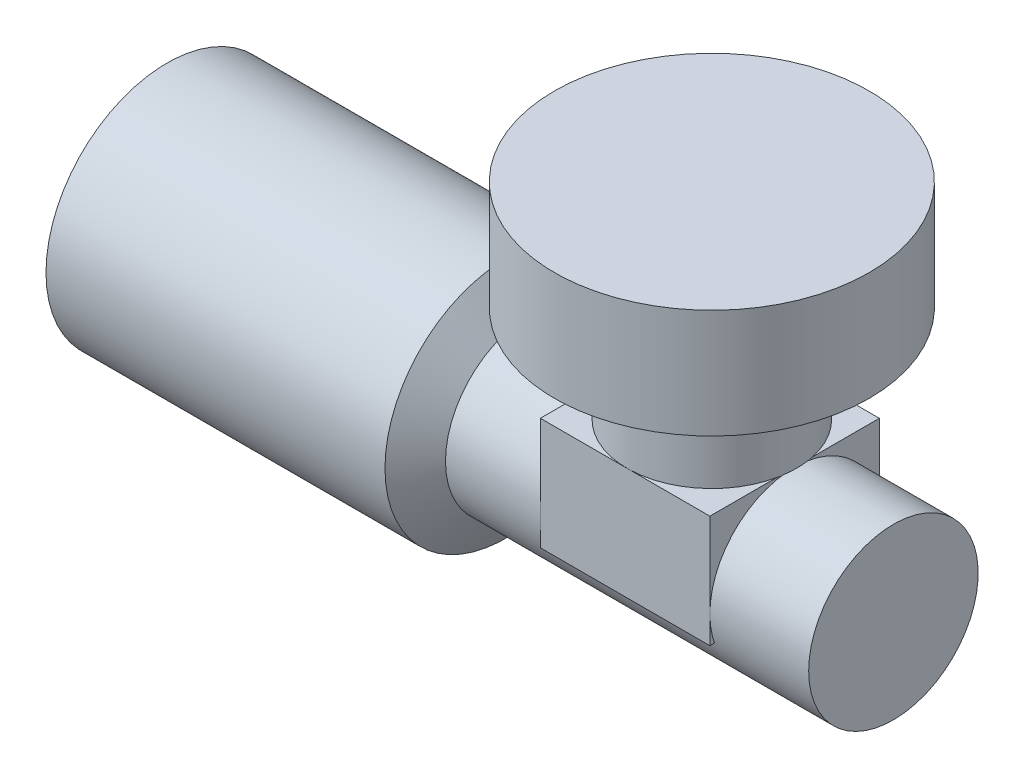
ISO-10303-21;
HEADER;
FILE_DESCRIPTION(('STEP AP214'),'2;1');
FILE_NAME('part.step','',(''),(''),'','','');
FILE_SCHEMA(('AUTOMOTIVE_DESIGN { 1 0 10303 214 1 1 1 1 }'));
ENDSEC;
DATA;
#1=APPLICATION_CONTEXT('core data for automotive mechanical design processes');
#2=APPLICATION_PROTOCOL_DEFINITION('international standard','automotive_design',2000,#1);
#3=PRODUCT_CONTEXT('',#1,'mechanical');
#4=PRODUCT('Part','Part','',(#3));
#5=PRODUCT_RELATED_PRODUCT_CATEGORY('part','',(#4));
#6=PRODUCT_DEFINITION_FORMATION('','',#4);
#7=PRODUCT_DEFINITION_CONTEXT('part definition',#1,'design');
#8=PRODUCT_DEFINITION('design','',#6,#7);
#9=PRODUCT_DEFINITION_SHAPE('','',#8);
#10=(LENGTH_UNIT() NAMED_UNIT(*) SI_UNIT(.MILLI.,.METRE.));
#11=(NAMED_UNIT(*) PLANE_ANGLE_UNIT() SI_UNIT($,.RADIAN.));
#12=(NAMED_UNIT(*) SI_UNIT($,.STERADIAN.) SOLID_ANGLE_UNIT());
#13=UNCERTAINTY_MEASURE_WITH_UNIT(LENGTH_MEASURE(1.E-05),#10,'distance_accuracy_value','');
#14=(GEOMETRIC_REPRESENTATION_CONTEXT(3) GLOBAL_UNCERTAINTY_ASSIGNED_CONTEXT((#13)) GLOBAL_UNIT_ASSIGNED_CONTEXT((#10,
#11,#12)) REPRESENTATION_CONTEXT('',''));
#15=CARTESIAN_POINT('',(0.,0.,0.));
#16=DIRECTION('',(0.,0.,1.));
#17=DIRECTION('',(1.,0.,0.));
#18=AXIS2_PLACEMENT_3D('',#15,#16,#17);
#19=CARTESIAN_POINT('',(20.5,7.,7.));
#20=DIRECTION('',(0.,0.,-1.));
#21=DIRECTION('',(-1.,0.,0.));
#22=AXIS2_PLACEMENT_3D('',#19,#20,#21);
#23=PLANE('',#22);
#24=DIRECTION('',(0.,-1.,0.));
#25=VECTOR('',#24,1.);
#26=CARTESIAN_POINT('',(6.5,7.,7.));
#27=LINE('',#26,#25);
#28=CARTESIAN_POINT('',(6.5,7.,7.));
#29=VERTEX_POINT('',#28);
#30=CARTESIAN_POINT('',(6.5,-2.26917805547654,7.));
#31=VERTEX_POINT('',#30);
#32=EDGE_CURVE('E106',#29,#31,#27,.T.);
#33=ORIENTED_EDGE('',*,*,#32,.T.);
#34=DIRECTION('',(-1.,0.,0.));
#35=VECTOR('',#34,1.);
#36=CARTESIAN_POINT('',(20.5,-2.26917805547654,7.));
#37=LINE('',#36,#35);
#38=CARTESIAN_POINT('',(20.5,-2.26917805547654,7.));
#39=VERTEX_POINT('',#38);
#40=EDGE_CURVE('E12',#39,#31,#37,.T.);
#41=ORIENTED_EDGE('',*,*,#40,.F.);
#42=DIRECTION('',(0.,-1.,0.));
#43=VECTOR('',#42,1.);
#44=CARTESIAN_POINT('',(20.5,7.,7.));
#45=LINE('',#44,#43);
#46=CARTESIAN_POINT('',(20.5,7.,7.));
#47=VERTEX_POINT('',#46);
#48=EDGE_CURVE('E94',#47,#39,#45,.T.);
#49=ORIENTED_EDGE('',*,*,#48,.F.);
#50=DIRECTION('',(-1.,0.,0.));
#51=VECTOR('',#50,1.);
#52=CARTESIAN_POINT('',(20.5,7.,7.));
#53=LINE('',#52,#51);
#54=EDGE_CURVE('E102',#47,#29,#53,.T.);
#55=ORIENTED_EDGE('',*,*,#54,.T.);
#56=EDGE_LOOP('',(#33,#41,#49,#55));
#57=FACE_BOUND('',#56,.T.);
#58=ADVANCED_FACE('F43',(#57),#23,.F.);
#59=CARTESIAN_POINT('',(20.5,-2.26917805547654,7.));
#60=DIRECTION('',(0.,1.,0.));
#61=DIRECTION('',(0.,0.,1.));
#62=AXIS2_PLACEMENT_3D('',#59,#60,#61);
#63=PLANE('',#62);
#64=DIRECTION('',(0.,0.,-1.));
#65=VECTOR('',#64,1.);
#66=CARTESIAN_POINT('',(6.5,-2.26917805547654,7.));
#67=LINE('',#66,#65);
#68=CARTESIAN_POINT('',(6.5,-2.26917805547654,-7.));
#69=VERTEX_POINT('',#68);
#70=EDGE_CURVE('E98',#31,#69,#67,.T.);
#71=ORIENTED_EDGE('',*,*,#70,.T.);
#72=DIRECTION('',(-1.,0.,0.));
#73=VECTOR('',#72,1.);
#74=CARTESIAN_POINT('',(20.5,-2.26917805547654,-7.));
#75=LINE('',#74,#73);
#76=CARTESIAN_POINT('',(20.5,-2.26917805547654,-7.));
#77=VERTEX_POINT('',#76);
#78=EDGE_CURVE('E51',#77,#69,#75,.T.);
#79=ORIENTED_EDGE('',*,*,#78,.F.);
#80=DIRECTION('',(0.,0.,-1.));
#81=VECTOR('',#80,1.);
#82=CARTESIAN_POINT('',(20.5,-2.26917805547654,7.));
#83=LINE('',#82,#81);
#84=EDGE_CURVE('E89',#39,#77,#83,.T.);
#85=ORIENTED_EDGE('',*,*,#84,.F.);
#86=ORIENTED_EDGE('',*,*,#40,.T.);
#87=EDGE_LOOP('',(#71,#79,#85,#86));
#88=FACE_BOUND('',#87,.T.);
#89=ADVANCED_FACE('F97',(#88),#63,.F.);
#90=CARTESIAN_POINT('',(20.5,7.,-7.));
#91=DIRECTION('',(0.,0.,1.));
#92=DIRECTION('',(1.,0.,0.));
#93=AXIS2_PLACEMENT_3D('',#90,#91,#92);
#94=PLANE('',#93);
#95=DIRECTION('',(0.,1.,0.));
#96=VECTOR('',#95,1.);
#97=CARTESIAN_POINT('',(6.5,7.,-7.));
#98=LINE('',#97,#96);
#99=CARTESIAN_POINT('',(6.5,7.,-7.));
#100=VERTEX_POINT('',#99);
#101=EDGE_CURVE('E76',#69,#100,#98,.T.);
#102=ORIENTED_EDGE('',*,*,#101,.T.);
#103=DIRECTION('',(-1.,0.,0.));
#104=VECTOR('',#103,1.);
#105=CARTESIAN_POINT('',(20.5,7.,-7.));
#106=LINE('',#105,#104);
#107=CARTESIAN_POINT('',(20.5,7.,-7.));
#108=VERTEX_POINT('',#107);
#109=EDGE_CURVE('E99',#108,#100,#106,.T.);
#110=ORIENTED_EDGE('',*,*,#109,.F.);
#111=DIRECTION('',(0.,1.,0.));
#112=VECTOR('',#111,1.);
#113=CARTESIAN_POINT('',(20.5,7.,-7.));
#114=LINE('',#113,#112);
#115=EDGE_CURVE('E92',#77,#108,#114,.T.);
#116=ORIENTED_EDGE('',*,*,#115,.F.);
#117=ORIENTED_EDGE('',*,*,#78,.T.);
#118=EDGE_LOOP('',(#102,#110,#116,#117));
#119=FACE_BOUND('',#118,.T.);
#120=ADVANCED_FACE('F100',(#119),#94,.F.);
#121=CARTESIAN_POINT('',(20.5,7.,7.));
#122=DIRECTION('',(0.,-1.,0.));
#123=DIRECTION('',(0.,0.,-1.));
#124=AXIS2_PLACEMENT_3D('',#121,#122,#123);
#125=PLANE('',#124);
#126=DIRECTION('',(0.,0.,1.));
#127=VECTOR('',#126,1.);
#128=CARTESIAN_POINT('',(6.5,7.,7.));
#129=LINE('',#128,#127);
#130=EDGE_CURVE('E82',#100,#29,#129,.T.);
#131=ORIENTED_EDGE('',*,*,#130,.T.);
#132=ORIENTED_EDGE('',*,*,#54,.F.);
#133=DIRECTION('',(0.,0.,1.));
#134=VECTOR('',#133,1.);
#135=CARTESIAN_POINT('',(20.5,7.,7.));
#136=LINE('',#135,#134);
#137=EDGE_CURVE('E59',#108,#47,#136,.T.);
#138=ORIENTED_EDGE('',*,*,#137,.F.);
#139=ORIENTED_EDGE('',*,*,#109,.T.);
#140=EDGE_LOOP('',(#131,#132,#138,#139));
#141=FACE_BOUND('',#140,.T.);
#142=ADVANCED_FACE('F113',(#141),#125,.F.);
#143=CARTESIAN_POINT('',(20.5,0.,0.));
#144=DIRECTION('',(1.,0.,0.));
#145=DIRECTION('',(0.,0.,-1.));
#146=AXIS2_PLACEMENT_3D('',#143,#144,#145);
#147=PLANE('',#146);
#148=ORIENTED_EDGE('',*,*,#48,.T.);
#149=ORIENTED_EDGE('',*,*,#84,.T.);
#150=ORIENTED_EDGE('',*,*,#115,.T.);
#151=ORIENTED_EDGE('',*,*,#137,.T.);
#152=EDGE_LOOP('',(#148,#149,#150,#151));
#153=FACE_BOUND('',#152,.T.);
#154=ADVANCED_FACE('F90',(#153),#147,.T.);
#155=CARTESIAN_POINT('',(6.5,0.,0.));
#156=DIRECTION('',(1.,0.,0.));
#157=DIRECTION('',(0.,0.,-1.));
#158=AXIS2_PLACEMENT_3D('',#155,#156,#157);
#159=PLANE('',#158);
#160=ORIENTED_EDGE('',*,*,#32,.F.);
#161=ORIENTED_EDGE('',*,*,#130,.F.);
#162=ORIENTED_EDGE('',*,*,#101,.F.);
#163=ORIENTED_EDGE('',*,*,#70,.F.);
#164=EDGE_LOOP('',(#160,#161,#162,#163));
#165=FACE_BOUND('',#164,.T.);
#166=ADVANCED_FACE('F116',(#165),#159,.F.);
#167=CLOSED_SHELL('',(#58,#89,#120,#142,#154,#166));
#168=MANIFOLD_SOLID_BREP('B2',#167);
#169=CARTESIAN_POINT('',(13.6629124709385,7.,0.));
#170=DIRECTION('',(0.,-1.,0.));
#171=DIRECTION('',(1.,0.,0.));
#172=AXIS2_PLACEMENT_3D('',#169,#170,#171);
#173=PLANE('',#172);
#174=CARTESIAN_POINT('',(13.6629124709385,7.,0.));
#175=DIRECTION('',(0.,1.,0.));
#176=DIRECTION('',(-1.,0.,0.));
#177=AXIS2_PLACEMENT_3D('',#174,#175,#176);
#178=CIRCLE('',#177,7.);
#179=CARTESIAN_POINT('',(6.66291247093846,7.,0.));
#180=VERTEX_POINT('',#179);
#181=EDGE_CURVE('E42',#180,#180,#178,.T.);
#182=ORIENTED_EDGE('',*,*,#181,.F.);
#183=EDGE_LOOP('',(#182));
#184=FACE_BOUND('',#183,.T.);
#185=ADVANCED_FACE('F173',(#184),#173,.T.);
#186=CARTESIAN_POINT('',(13.6629124709385,24.,0.));
#187=DIRECTION('',(0.,1.,0.));
#188=DIRECTION('',(-1.,0.,0.));
#189=AXIS2_PLACEMENT_3D('',#186,#187,#188);
#190=CYLINDRICAL_SURFACE('',#189,7.);
#191=ORIENTED_EDGE('',*,*,#181,.T.);
#192=EDGE_LOOP('',(#191));
#193=FACE_BOUND('',#192,.T.);
#194=CARTESIAN_POINT('',(13.6629124709385,13.,0.));
#195=DIRECTION('',(0.,1.,0.));
#196=DIRECTION('',(-1.,0.,0.));
#197=AXIS2_PLACEMENT_3D('',#194,#195,#196);
#198=CIRCLE('',#197,7.);
#199=CARTESIAN_POINT('',(6.66291247093846,13.,0.));
#200=VERTEX_POINT('',#199);
#201=EDGE_CURVE('E179',#200,#200,#198,.T.);
#202=ORIENTED_EDGE('',*,*,#201,.F.);
#203=EDGE_LOOP('',(#202));
#204=FACE_BOUND('',#203,.T.);
#205=ADVANCED_FACE('F205',(#193,#204),#190,.T.);
#206=CARTESIAN_POINT('',(13.6629124709385,15.,0.));
#207=DIRECTION('',(0.,1.,0.));
#208=DIRECTION('',(-1.,0.,0.));
#209=AXIS2_PLACEMENT_3D('',#206,#207,#208);
#210=CONICAL_SURFACE('',#209,13.,1.24904577239825);
#211=ORIENTED_EDGE('',*,*,#201,.T.);
#212=EDGE_LOOP('',(#211));
#213=FACE_BOUND('',#212,.T.);
#214=CARTESIAN_POINT('',(13.6629124709385,15.,0.));
#215=DIRECTION('',(0.,1.,0.));
#216=DIRECTION('',(-1.,0.,0.));
#217=AXIS2_PLACEMENT_3D('',#214,#215,#216);
#218=CIRCLE('',#217,13.);
#219=CARTESIAN_POINT('',(0.662912470938458,15.,0.));
#220=VERTEX_POINT('',#219);
#221=EDGE_CURVE('E183',#220,#220,#218,.T.);
#222=ORIENTED_EDGE('',*,*,#221,.F.);
#223=EDGE_LOOP('',(#222));
#224=FACE_BOUND('',#223,.T.);
#225=ADVANCED_FACE('F197',(#213,#224),#210,.T.);
#226=CARTESIAN_POINT('',(13.6629124709385,24.,0.));
#227=DIRECTION('',(0.,1.,0.));
#228=DIRECTION('',(-1.,0.,0.));
#229=AXIS2_PLACEMENT_3D('',#226,#227,#228);
#230=CYLINDRICAL_SURFACE('',#229,13.);
#231=ORIENTED_EDGE('',*,*,#221,.T.);
#232=EDGE_LOOP('',(#231));
#233=FACE_BOUND('',#232,.T.);
#234=CARTESIAN_POINT('',(13.6629124709385,24.,0.));
#235=DIRECTION('',(0.,1.,0.));
#236=DIRECTION('',(-1.,0.,0.));
#237=AXIS2_PLACEMENT_3D('',#234,#235,#236);
#238=CIRCLE('',#237,13.);
#239=CARTESIAN_POINT('',(0.662912470938458,24.,0.));
#240=VERTEX_POINT('',#239);
#241=EDGE_CURVE('E187',#240,#240,#238,.T.);
#242=ORIENTED_EDGE('',*,*,#241,.F.);
#243=EDGE_LOOP('',(#242));
#244=FACE_BOUND('',#243,.T.);
#245=ADVANCED_FACE('F195',(#233,#244),#230,.T.);
#246=CARTESIAN_POINT('',(0.662912470938458,24.,0.));
#247=DIRECTION('',(0.,1.,0.));
#248=DIRECTION('',(-1.,0.,0.));
#249=AXIS2_PLACEMENT_3D('',#246,#247,#248);
#250=PLANE('',#249);
#251=ORIENTED_EDGE('',*,*,#241,.T.);
#252=EDGE_LOOP('',(#251));
#253=FACE_BOUND('',#252,.T.);
#254=ADVANCED_FACE('F193',(#253),#250,.T.);
#255=CLOSED_SHELL('',(#185,#205,#225,#245,#254));
#256=MANIFOLD_SOLID_BREP('B6',#255);
#257=CARTESIAN_POINT('',(-31.3370875290615,0.,0.));
#258=DIRECTION('',(1.,0.,0.));
#259=DIRECTION('',(0.,0.,-1.));
#260=AXIS2_PLACEMENT_3D('',#257,#258,#259);
#261=PLANE('',#260);
#262=CARTESIAN_POINT('',(-31.3370875290615,0.,0.));
#263=DIRECTION('',(-1.,0.,0.));
#264=DIRECTION('',(0.,0.,1.));
#265=AXIS2_PLACEMENT_3D('',#262,#263,#264);
#266=CIRCLE('',#265,9.99999999999999);
#267=CARTESIAN_POINT('',(-31.3370875290615,0.,9.99999999999999));
#268=VERTEX_POINT('',#267);
#269=EDGE_CURVE('E172',#268,#268,#266,.T.);
#270=ORIENTED_EDGE('',*,*,#269,.T.);
#271=EDGE_LOOP('',(#270));
#272=FACE_BOUND('',#271,.T.);
#273=ADVANCED_FACE('F243',(#272),#261,.F.);
#274=CARTESIAN_POINT('',(-36.3804173905441,0.,0.));
#275=DIRECTION('',(-1.,0.,0.));
#276=DIRECTION('',(0.,0.,1.));
#277=AXIS2_PLACEMENT_3D('',#274,#275,#276);
#278=CYLINDRICAL_SURFACE('',#277,9.99999999999999);
#279=ORIENTED_EDGE('',*,*,#269,.F.);
#280=EDGE_LOOP('',(#279));
#281=FACE_BOUND('',#280,.T.);
#282=CARTESIAN_POINT('',(-3.33708752906154,0.,0.));
#283=DIRECTION('',(-1.,0.,0.));
#284=DIRECTION('',(0.,0.,1.));
#285=AXIS2_PLACEMENT_3D('',#282,#283,#284);
#286=CIRCLE('',#285,9.99999999999999);
#287=CARTESIAN_POINT('',(-3.33708752906154,0.,9.99999999999999));
#288=VERTEX_POINT('',#287);
#289=EDGE_CURVE('E249',#288,#288,#286,.T.);
#290=ORIENTED_EDGE('',*,*,#289,.T.);
#291=EDGE_LOOP('',(#290));
#292=FACE_BOUND('',#291,.T.);
#293=ADVANCED_FACE('F275',(#281,#292),#278,.T.);
#294=CARTESIAN_POINT('',(-1.33708752906154,0.,0.));
#295=DIRECTION('',(-1.,0.,0.));
#296=DIRECTION('',(0.,0.,1.));
#297=AXIS2_PLACEMENT_3D('',#294,#295,#296);
#298=CONICAL_SURFACE('',#297,7.,0.982793723247328);
#299=ORIENTED_EDGE('',*,*,#289,.F.);
#300=EDGE_LOOP('',(#299));
#301=FACE_BOUND('',#300,.T.);
#302=CARTESIAN_POINT('',(-1.33708752906154,0.,0.));
#303=DIRECTION('',(-1.,0.,0.));
#304=DIRECTION('',(0.,0.,1.));
#305=AXIS2_PLACEMENT_3D('',#302,#303,#304);
#306=CIRCLE('',#305,7.);
#307=CARTESIAN_POINT('',(-1.33708752906154,0.,7.));
#308=VERTEX_POINT('',#307);
#309=EDGE_CURVE('E253',#308,#308,#306,.T.);
#310=ORIENTED_EDGE('',*,*,#309,.T.);
#311=EDGE_LOOP('',(#310));
#312=FACE_BOUND('',#311,.T.);
#313=ADVANCED_FACE('F271',(#301,#312),#298,.T.);
#314=CARTESIAN_POINT('',(-36.3804173905441,0.,0.));
#315=DIRECTION('',(-1.,0.,0.));
#316=DIRECTION('',(0.,0.,1.));
#317=AXIS2_PLACEMENT_3D('',#314,#315,#316);
#318=CYLINDRICAL_SURFACE('',#317,7.);
#319=ORIENTED_EDGE('',*,*,#309,.F.);
#320=EDGE_LOOP('',(#319));
#321=FACE_BOUND('',#320,.T.);
#322=CARTESIAN_POINT('',(28.6629124709385,0.,0.));
#323=DIRECTION('',(-1.,0.,0.));
#324=DIRECTION('',(0.,0.,1.));
#325=AXIS2_PLACEMENT_3D('',#322,#323,#324);
#326=CIRCLE('',#325,7.);
#327=CARTESIAN_POINT('',(28.6629124709385,0.,7.));
#328=VERTEX_POINT('',#327);
#329=EDGE_CURVE('E257',#328,#328,#326,.T.);
#330=ORIENTED_EDGE('',*,*,#329,.T.);
#331=EDGE_LOOP('',(#330));
#332=FACE_BOUND('',#331,.T.);
#333=ADVANCED_FACE('F263',(#321,#332),#318,.T.);
#334=CARTESIAN_POINT('',(28.6629124709385,0.,-7.));
#335=DIRECTION('',(-1.,0.,0.));
#336=DIRECTION('',(0.,0.,1.));
#337=AXIS2_PLACEMENT_3D('',#334,#335,#336);
#338=PLANE('',#337);
#339=ORIENTED_EDGE('',*,*,#329,.F.);
#340=EDGE_LOOP('',(#339));
#341=FACE_BOUND('',#340,.T.);
#342=ADVANCED_FACE('F265',(#341),#338,.F.);
#343=CLOSED_SHELL('',(#273,#293,#313,#333,#342));
#344=MANIFOLD_SOLID_BREP('B37',#343);
#345=ADVANCED_BREP_SHAPE_REPRESENTATION('',(#18,#168,#256,#344),#14);
#346=SHAPE_DEFINITION_REPRESENTATION(#9,#345);
ENDSEC;
END-ISO-10303-21;
